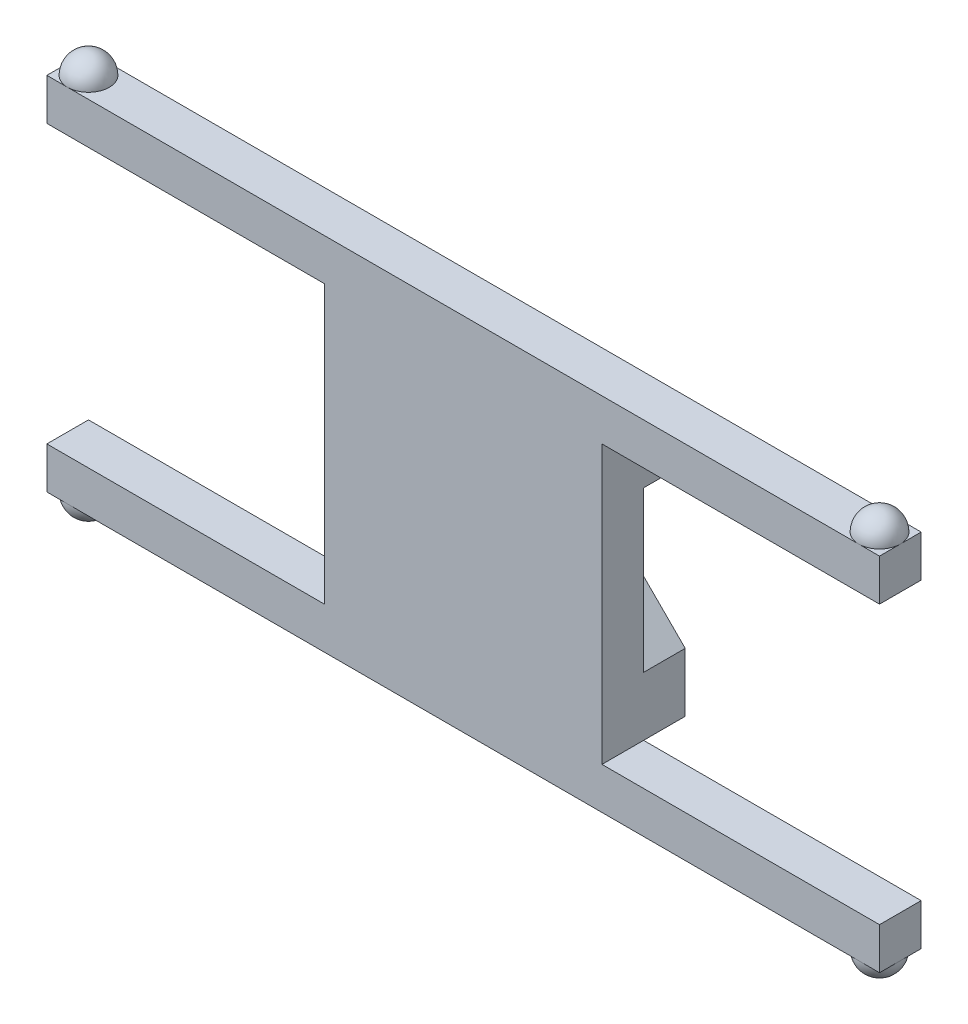
ISO-10303-21;
HEADER;
FILE_DESCRIPTION(('STEP AP214'),'2;1');
FILE_NAME('part.step','',(''),(''),'','','');
FILE_SCHEMA(('AUTOMOTIVE_DESIGN { 1 0 10303 214 1 1 1 1 }'));
ENDSEC;
DATA;
#1=APPLICATION_CONTEXT('core data for automotive mechanical design processes');
#2=APPLICATION_PROTOCOL_DEFINITION('international standard','automotive_design',2000,#1);
#3=PRODUCT_CONTEXT('',#1,'mechanical');
#4=PRODUCT('Part','Part','',(#3));
#5=PRODUCT_RELATED_PRODUCT_CATEGORY('part','',(#4));
#6=PRODUCT_DEFINITION_FORMATION('','',#4);
#7=PRODUCT_DEFINITION_CONTEXT('part definition',#1,'design');
#8=PRODUCT_DEFINITION('design','',#6,#7);
#9=PRODUCT_DEFINITION_SHAPE('','',#8);
#10=(LENGTH_UNIT() NAMED_UNIT(*) SI_UNIT(.MILLI.,.METRE.));
#11=(NAMED_UNIT(*) PLANE_ANGLE_UNIT() SI_UNIT($,.RADIAN.));
#12=(NAMED_UNIT(*) SI_UNIT($,.STERADIAN.) SOLID_ANGLE_UNIT());
#13=UNCERTAINTY_MEASURE_WITH_UNIT(LENGTH_MEASURE(1.E-05),#10,'distance_accuracy_value','');
#14=(GEOMETRIC_REPRESENTATION_CONTEXT(3) GLOBAL_UNCERTAINTY_ASSIGNED_CONTEXT((#13)) GLOBAL_UNIT_ASSIGNED_CONTEXT((#10,
#11,#12)) REPRESENTATION_CONTEXT('',''));
#15=CARTESIAN_POINT('',(0.,0.,0.));
#16=DIRECTION('',(0.,0.,1.));
#17=DIRECTION('',(1.,0.,0.));
#18=AXIS2_PLACEMENT_3D('',#15,#16,#17);
#19=CARTESIAN_POINT('',(-27.,3.,3.));
#20=DIRECTION('',(0.,1.,0.));
#21=DIRECTION('',(0.,0.,1.));
#22=AXIS2_PLACEMENT_3D('',#19,#20,#21);
#23=PLANE('',#22);
#24=CARTESIAN_POINT('',(-28.5,3.,1.5));
#25=DIRECTION('',(0.,1.,0.));
#26=DIRECTION('',(0.,0.,1.));
#27=AXIS2_PLACEMENT_3D('',#24,#25,#26);
#28=CIRCLE('',#27,1.5);
#29=CARTESIAN_POINT('',(-28.5,3.,3.));
#30=VERTEX_POINT('',#29);
#31=CARTESIAN_POINT('',(-28.5,3.,0.));
#32=VERTEX_POINT('',#31);
#33=EDGE_CURVE('E11',#30,#32,#28,.T.);
#34=ORIENTED_EDGE('',*,*,#33,.F.);
#35=DIRECTION('',(-1.,0.,0.));
#36=VECTOR('',#35,1.);
#37=CARTESIAN_POINT('',(-27.,3.,3.));
#38=LINE('',#37,#36);
#39=CARTESIAN_POINT('',(28.5,3.,3.));
#40=VERTEX_POINT('',#39);
#41=EDGE_CURVE('E248',#40,#30,#38,.T.);
#42=ORIENTED_EDGE('',*,*,#41,.F.);
#43=CARTESIAN_POINT('',(28.5,3.,1.5));
#44=DIRECTION('',(0.,-1.,0.));
#45=DIRECTION('',(0.,0.,-1.));
#46=AXIS2_PLACEMENT_3D('',#43,#44,#45);
#47=CIRCLE('',#46,1.5);
#48=CARTESIAN_POINT('',(28.5,3.00000000000001,0.));
#49=VERTEX_POINT('',#48);
#50=EDGE_CURVE('E393',#40,#49,#47,.T.);
#51=ORIENTED_EDGE('',*,*,#50,.T.);
#52=DIRECTION('',(1.,0.,0.));
#53=VECTOR('',#52,1.);
#54=CARTESIAN_POINT('',(-27.,3.,0.));
#55=LINE('',#54,#53);
#56=EDGE_CURVE('E262',#32,#49,#55,.T.);
#57=ORIENTED_EDGE('',*,*,#56,.F.);
#58=EDGE_LOOP('',(#34,#42,#51,#57));
#59=FACE_BOUND('',#58,.T.);
#60=ADVANCED_FACE('F37',(#59),#23,.T.);
#61=CARTESIAN_POINT('',(-30.,3.,1.5));
#62=VERTEX_POINT('',#61);
#63=EDGE_CURVE('E46',#32,#62,#28,.T.);
#64=ORIENTED_EDGE('',*,*,#63,.F.);
#65=CARTESIAN_POINT('',(-30.,3.,0.));
#66=VERTEX_POINT('',#65);
#67=EDGE_CURVE('E261',#66,#32,#55,.T.);
#68=ORIENTED_EDGE('',*,*,#67,.F.);
#69=DIRECTION('',(0.,0.,-1.));
#70=VECTOR('',#69,1.);
#71=CARTESIAN_POINT('',(-30.,3.,3.));
#72=LINE('',#71,#70);
#73=EDGE_CURVE('E288',#62,#66,#72,.T.);
#74=ORIENTED_EDGE('',*,*,#73,.F.);
#75=EDGE_LOOP('',(#64,#68,#74));
#76=FACE_BOUND('',#75,.T.);
#77=ADVANCED_FACE('F597',(#76),#23,.T.);
#78=CARTESIAN_POINT('',(27.,-23.,3.));
#79=DIRECTION('',(0.,1.,0.));
#80=DIRECTION('',(0.,0.,1.));
#81=AXIS2_PLACEMENT_3D('',#78,#79,#80);
#82=PLANE('',#81);
#83=DIRECTION('',(1.,0.,0.));
#84=VECTOR('',#83,1.);
#85=CARTESIAN_POINT('',(-29.9999999999998,-23.0000000000002,3.));
#86=LINE('',#85,#84);
#87=CARTESIAN_POINT('',(-28.4999999999998,-23.,3.));
#88=VERTEX_POINT('',#87);
#89=CARTESIAN_POINT('',(28.5,-23.,3.));
#90=VERTEX_POINT('',#89);
#91=EDGE_CURVE('E376',#88,#90,#86,.T.);
#92=ORIENTED_EDGE('',*,*,#91,.F.);
#93=CARTESIAN_POINT('',(-28.4999999999998,-23.,1.5));
#94=DIRECTION('',(0.,1.,0.));
#95=DIRECTION('',(0.,0.,1.));
#96=AXIS2_PLACEMENT_3D('',#93,#94,#95);
#97=CIRCLE('',#96,1.5);
#98=CARTESIAN_POINT('',(-28.4999999999998,-23.,0.));
#99=VERTEX_POINT('',#98);
#100=EDGE_CURVE('E266',#88,#99,#97,.T.);
#101=ORIENTED_EDGE('',*,*,#100,.T.);
#102=DIRECTION('',(1.,0.,0.));
#103=VECTOR('',#102,1.);
#104=CARTESIAN_POINT('',(27.,-23.,0.));
#105=LINE('',#104,#103);
#106=CARTESIAN_POINT('',(28.5,-23.,0.));
#107=VERTEX_POINT('',#106);
#108=EDGE_CURVE('E342',#99,#107,#105,.T.);
#109=ORIENTED_EDGE('',*,*,#108,.T.);
#110=CARTESIAN_POINT('',(28.5,-23.,1.5));
#111=DIRECTION('',(0.,1.,0.));
#112=DIRECTION('',(0.,0.,1.));
#113=AXIS2_PLACEMENT_3D('',#110,#111,#112);
#114=CIRCLE('',#113,1.5);
#115=EDGE_CURVE('E276',#90,#107,#114,.F.);
#116=ORIENTED_EDGE('',*,*,#115,.F.);
#117=EDGE_LOOP('',(#92,#101,#109,#116));
#118=FACE_BOUND('',#117,.T.);
#119=ADVANCED_FACE('F602',(#118),#82,.F.);
#120=CARTESIAN_POINT('',(-29.9999999999998,-23.0000000000002,0.));
#121=VERTEX_POINT('',#120);
#122=EDGE_CURVE('E339',#121,#99,#105,.T.);
#123=ORIENTED_EDGE('',*,*,#122,.T.);
#124=CARTESIAN_POINT('',(-29.9999999999998,-23.,1.5));
#125=VERTEX_POINT('',#124);
#126=EDGE_CURVE('E268',#99,#125,#97,.T.);
#127=ORIENTED_EDGE('',*,*,#126,.T.);
#128=DIRECTION('',(0.,0.,-1.));
#129=VECTOR('',#128,1.);
#130=CARTESIAN_POINT('',(-29.9999999999998,-23.0000000000002,3.));
#131=LINE('',#130,#129);
#132=EDGE_CURVE('E303',#125,#121,#131,.T.);
#133=ORIENTED_EDGE('',*,*,#132,.T.);
#134=EDGE_LOOP('',(#123,#127,#133));
#135=FACE_BOUND('',#134,.T.);
#136=ADVANCED_FACE('F665',(#135),#82,.F.);
#137=CARTESIAN_POINT('',(-29.9999999999998,-23.0000000000002,3.));
#138=VERTEX_POINT('',#137);
#139=EDGE_CURVE('E301',#138,#125,#131,.T.);
#140=ORIENTED_EDGE('',*,*,#139,.T.);
#141=EDGE_CURVE('E269',#125,#88,#97,.T.);
#142=ORIENTED_EDGE('',*,*,#141,.T.);
#143=EDGE_CURVE('E373',#138,#88,#86,.T.);
#144=ORIENTED_EDGE('',*,*,#143,.F.);
#145=EDGE_LOOP('',(#140,#142,#144));
#146=FACE_BOUND('',#145,.T.);
#147=ADVANCED_FACE('F661',(#146),#82,.F.);
#148=CARTESIAN_POINT('',(30.,-23.,1.5));
#149=VERTEX_POINT('',#148);
#150=EDGE_CURVE('E281',#107,#149,#114,.F.);
#151=ORIENTED_EDGE('',*,*,#150,.F.);
#152=CARTESIAN_POINT('',(30.,-23.,0.));
#153=VERTEX_POINT('',#152);
#154=EDGE_CURVE('E343',#107,#153,#105,.T.);
#155=ORIENTED_EDGE('',*,*,#154,.T.);
#156=DIRECTION('',(0.,0.,-1.));
#157=VECTOR('',#156,1.);
#158=CARTESIAN_POINT('',(30.,-23.,3.));
#159=LINE('',#158,#157);
#160=EDGE_CURVE('E307',#149,#153,#159,.T.);
#161=ORIENTED_EDGE('',*,*,#160,.F.);
#162=EDGE_LOOP('',(#151,#155,#161));
#163=FACE_BOUND('',#162,.T.);
#164=ADVANCED_FACE('F664',(#163),#82,.F.);
#165=EDGE_CURVE('E282',#149,#90,#114,.F.);
#166=ORIENTED_EDGE('',*,*,#165,.F.);
#167=CARTESIAN_POINT('',(30.,-23.,3.));
#168=VERTEX_POINT('',#167);
#169=EDGE_CURVE('E304',#168,#149,#159,.T.);
#170=ORIENTED_EDGE('',*,*,#169,.F.);
#171=EDGE_CURVE('E377',#90,#168,#86,.T.);
#172=ORIENTED_EDGE('',*,*,#171,.F.);
#173=EDGE_LOOP('',(#166,#170,#172));
#174=FACE_BOUND('',#173,.T.);
#175=ADVANCED_FACE('F666',(#174),#82,.F.);
#176=CARTESIAN_POINT('',(0.,0.,0.));
#177=DIRECTION('',(0.,0.,1.));
#178=DIRECTION('',(1.,0.,0.));
#179=AXIS2_PLACEMENT_3D('',#176,#177,#178);
#180=PLANE('',#179);
#181=DIRECTION('',(-0.707106781186547,-0.707106781186548,0.));
#182=VECTOR('',#181,1.);
#183=CARTESIAN_POINT('',(7.12132034355964,-7.12132034355963,0.));
#184=LINE('',#183,#182);
#185=CARTESIAN_POINT('',(10.,-4.24264068711927,0.));
#186=VERTEX_POINT('',#185);
#187=CARTESIAN_POINT('',(4.24264068711928,-9.99999999999999,0.));
#188=VERTEX_POINT('',#187);
#189=EDGE_CURVE('E463',#186,#188,#184,.T.);
#190=ORIENTED_EDGE('',*,*,#189,.F.);
#191=DIRECTION('',(0.,-1.,0.));
#192=VECTOR('',#191,1.);
#193=CARTESIAN_POINT('',(10.,0.,0.));
#194=LINE('',#193,#192);
#195=CARTESIAN_POINT('',(10.,-15.7573593128807,0.));
#196=VERTEX_POINT('',#195);
#197=EDGE_CURVE('E330',#186,#196,#194,.T.);
#198=ORIENTED_EDGE('',*,*,#197,.T.);
#199=DIRECTION('',(0.707106781186548,-0.707106781186548,0.));
#200=VECTOR('',#199,1.);
#201=CARTESIAN_POINT('',(-2.87867965644036,-2.87867965644036,0.));
#202=LINE('',#201,#200);
#203=EDGE_CURVE('E461',#188,#196,#202,.T.);
#204=ORIENTED_EDGE('',*,*,#203,.F.);
#205=EDGE_LOOP('',(#190,#198,#204));
#206=FACE_BOUND('',#205,.T.);
#207=ADVANCED_FACE('F518',(#206),#180,.F.);
#208=DIRECTION('',(0.707106781186548,-0.707106781186548,0.));
#209=VECTOR('',#208,1.);
#210=CARTESIAN_POINT('',(-7.12132034355964,-7.12132034355964,0.));
#211=LINE('',#210,#209);
#212=CARTESIAN_POINT('',(0.,-14.2426406871193,0.));
#213=VERTEX_POINT('',#212);
#214=CARTESIAN_POINT('',(5.75735931288072,-20.,0.));
#215=VERTEX_POINT('',#214);
#216=EDGE_CURVE('E455',#213,#215,#211,.T.);
#217=ORIENTED_EDGE('',*,*,#216,.T.);
#218=DIRECTION('',(1.,0.,0.));
#219=VECTOR('',#218,1.);
#220=CARTESIAN_POINT('',(0.,-20.,0.));
#221=LINE('',#220,#219);
#222=CARTESIAN_POINT('',(10.,-20.,0.));
#223=VERTEX_POINT('',#222);
#224=EDGE_CURVE('E458',#215,#223,#221,.T.);
#225=ORIENTED_EDGE('',*,*,#224,.T.);
#226=DIRECTION('',(1.,0.,0.));
#227=VECTOR('',#226,1.);
#228=CARTESIAN_POINT('',(10.,-20.,0.));
#229=LINE('',#228,#227);
#230=CARTESIAN_POINT('',(30.,-20.,0.));
#231=VERTEX_POINT('',#230);
#232=EDGE_CURVE('E333',#223,#231,#229,.T.);
#233=ORIENTED_EDGE('',*,*,#232,.T.);
#234=DIRECTION('',(0.,1.,0.));
#235=VECTOR('',#234,1.);
#236=CARTESIAN_POINT('',(30.,-23.,0.));
#237=LINE('',#236,#235);
#238=EDGE_CURVE('E336',#153,#231,#237,.T.);
#239=ORIENTED_EDGE('',*,*,#238,.F.);
#240=ORIENTED_EDGE('',*,*,#154,.F.);
#241=ORIENTED_EDGE('',*,*,#108,.F.);
#242=ORIENTED_EDGE('',*,*,#122,.F.);
#243=DIRECTION('',(0.,1.,0.));
#244=VECTOR('',#243,1.);
#245=CARTESIAN_POINT('',(-29.9999999999998,-23.0000000000002,0.));
#246=LINE('',#245,#244);
#247=CARTESIAN_POINT('',(-29.9999999999999,-20.0000000000002,0.));
#248=VERTEX_POINT('',#247);
#249=EDGE_CURVE('E344',#121,#248,#246,.T.);
#250=ORIENTED_EDGE('',*,*,#249,.T.);
#251=DIRECTION('',(-1.,0.,0.));
#252=VECTOR('',#251,1.);
#253=CARTESIAN_POINT('',(-9.99999999999986,-20.,0.));
#254=LINE('',#253,#252);
#255=CARTESIAN_POINT('',(-9.99999999999986,-20.,0.));
#256=VERTEX_POINT('',#255);
#257=EDGE_CURVE('E347',#256,#248,#254,.T.);
#258=ORIENTED_EDGE('',*,*,#257,.F.);
#259=DIRECTION('',(1.,0.,0.));
#260=VECTOR('',#259,1.);
#261=CARTESIAN_POINT('',(0.,-20.,0.));
#262=LINE('',#261,#260);
#263=CARTESIAN_POINT('',(-5.75735931288072,-20.,0.));
#264=VERTEX_POINT('',#263);
#265=EDGE_CURVE('E449',#256,#264,#262,.T.);
#266=ORIENTED_EDGE('',*,*,#265,.T.);
#267=DIRECTION('',(-0.707106781186547,-0.707106781186548,0.));
#268=VECTOR('',#267,1.);
#269=CARTESIAN_POINT('',(7.12132034355964,-7.12132034355963,0.));
#270=LINE('',#269,#268);
#271=EDGE_CURVE('E452',#213,#264,#270,.T.);
#272=ORIENTED_EDGE('',*,*,#271,.F.);
#273=EDGE_LOOP('',(#217,#225,#233,#239,#240,#241,#242,#250,#258,#266,#272));
#274=FACE_BOUND('',#273,.T.);
#275=ADVANCED_FACE('F585',(#274),#180,.F.);
#276=DIRECTION('',(0.707106781186548,-0.707106781186548,0.));
#277=VECTOR('',#276,1.);
#278=CARTESIAN_POINT('',(-7.12132034355964,-7.12132034355964,0.));
#279=LINE('',#278,#277);
#280=CARTESIAN_POINT('',(-9.99999999999997,-4.24264068711931,0.));
#281=VERTEX_POINT('',#280);
#282=CARTESIAN_POINT('',(-4.24264068711924,-10.,0.));
#283=VERTEX_POINT('',#282);
#284=EDGE_CURVE('E443',#281,#283,#279,.T.);
#285=ORIENTED_EDGE('',*,*,#284,.T.);
#286=DIRECTION('',(-0.707106781186545,-0.70710678118655,0.));
#287=VECTOR('',#286,1.);
#288=CARTESIAN_POINT('',(2.87867965644038,-2.87867965644036,0.));
#289=LINE('',#288,#287);
#290=CARTESIAN_POINT('',(-9.99999999999989,-15.7573593128807,0.));
#291=VERTEX_POINT('',#290);
#292=EDGE_CURVE('E446',#283,#291,#289,.T.);
#293=ORIENTED_EDGE('',*,*,#292,.T.);
#294=DIRECTION('',(0.,-1.,0.));
#295=VECTOR('',#294,1.);
#296=CARTESIAN_POINT('',(-10.,0.,0.));
#297=LINE('',#296,#295);
#298=EDGE_CURVE('E350',#281,#291,#297,.T.);
#299=ORIENTED_EDGE('',*,*,#298,.F.);
#300=EDGE_LOOP('',(#285,#293,#299));
#301=FACE_BOUND('',#300,.T.);
#302=ADVANCED_FACE('F607',(#301),#180,.F.);
#303=EDGE_CURVE('E41',#62,#30,#28,.T.);
#304=ORIENTED_EDGE('',*,*,#303,.F.);
#305=CARTESIAN_POINT('',(-30.,3.,3.));
#306=VERTEX_POINT('',#305);
#307=EDGE_CURVE('E260',#306,#62,#72,.T.);
#308=ORIENTED_EDGE('',*,*,#307,.F.);
#309=EDGE_CURVE('E250',#30,#306,#38,.T.);
#310=ORIENTED_EDGE('',*,*,#309,.F.);
#311=EDGE_LOOP('',(#304,#308,#310));
#312=FACE_BOUND('',#311,.T.);
#313=ADVANCED_FACE('F258',(#312),#23,.T.);
#314=CARTESIAN_POINT('',(30.,3.,0.));
#315=VERTEX_POINT('',#314);
#316=EDGE_CURVE('E323',#49,#315,#55,.T.);
#317=ORIENTED_EDGE('',*,*,#316,.F.);
#318=CARTESIAN_POINT('',(30.,3.,1.5));
#319=VERTEX_POINT('',#318);
#320=EDGE_CURVE('E359',#49,#319,#47,.T.);
#321=ORIENTED_EDGE('',*,*,#320,.T.);
#322=DIRECTION('',(0.,0.,-1.));
#323=VECTOR('',#322,1.);
#324=CARTESIAN_POINT('',(30.,3.,3.));
#325=LINE('',#324,#323);
#326=EDGE_CURVE('E321',#319,#315,#325,.T.);
#327=ORIENTED_EDGE('',*,*,#326,.T.);
#328=EDGE_LOOP('',(#317,#321,#327));
#329=FACE_BOUND('',#328,.T.);
#330=ADVANCED_FACE('F603',(#329),#23,.T.);
#331=CARTESIAN_POINT('',(30.,3.,3.));
#332=VERTEX_POINT('',#331);
#333=EDGE_CURVE('E318',#332,#319,#325,.T.);
#334=ORIENTED_EDGE('',*,*,#333,.T.);
#335=EDGE_CURVE('E392',#319,#40,#47,.T.);
#336=ORIENTED_EDGE('',*,*,#335,.T.);
#337=EDGE_CURVE('E253',#332,#40,#38,.T.);
#338=ORIENTED_EDGE('',*,*,#337,.F.);
#339=EDGE_LOOP('',(#334,#336,#338));
#340=FACE_BOUND('',#339,.T.);
#341=ADVANCED_FACE('F608',(#340),#23,.T.);
#342=CARTESIAN_POINT('',(-30.,3.,3.));
#343=DIRECTION('',(1.,0.,0.));
#344=DIRECTION('',(0.,1.,0.));
#345=AXIS2_PLACEMENT_3D('',#342,#343,#344);
#346=PLANE('',#345);
#347=DIRECTION('',(0.,-1.,0.));
#348=VECTOR('',#347,1.);
#349=CARTESIAN_POINT('',(-30.,3.,0.));
#350=LINE('',#349,#348);
#351=CARTESIAN_POINT('',(-30.,-2.22044604925031E-13,0.));
#352=VERTEX_POINT('',#351);
#353=EDGE_CURVE('E356',#66,#352,#350,.T.);
#354=ORIENTED_EDGE('',*,*,#353,.T.);
#355=DIRECTION('',(0.,0.,-1.));
#356=VECTOR('',#355,1.);
#357=CARTESIAN_POINT('',(-30.,-2.22044604925031E-13,3.));
#358=LINE('',#357,#356);
#359=CARTESIAN_POINT('',(-30.,-2.22044604925031E-13,3.));
#360=VERTEX_POINT('',#359);
#361=EDGE_CURVE('E290',#360,#352,#358,.T.);
#362=ORIENTED_EDGE('',*,*,#361,.F.);
#363=DIRECTION('',(0.,-1.,0.));
#364=VECTOR('',#363,1.);
#365=CARTESIAN_POINT('',(-30.,3.,3.));
#366=LINE('',#365,#364);
#367=EDGE_CURVE('E388',#306,#360,#366,.T.);
#368=ORIENTED_EDGE('',*,*,#367,.F.);
#369=ORIENTED_EDGE('',*,*,#307,.T.);
#370=ORIENTED_EDGE('',*,*,#73,.T.);
#371=EDGE_LOOP('',(#354,#362,#368,#369,#370));
#372=FACE_BOUND('',#371,.T.);
#373=ADVANCED_FACE('F39',(#372),#346,.F.);
#374=CARTESIAN_POINT('',(-10.,0.,3.));
#375=DIRECTION('',(0.,-1.,0.));
#376=DIRECTION('',(1.,0.,0.));
#377=AXIS2_PLACEMENT_3D('',#374,#375,#376);
#378=PLANE('',#377);
#379=DIRECTION('',(-1.,0.,0.));
#380=VECTOR('',#379,1.);
#381=CARTESIAN_POINT('',(-10.,0.,0.));
#382=LINE('',#381,#380);
#383=CARTESIAN_POINT('',(-10.,0.,0.));
#384=VERTEX_POINT('',#383);
#385=EDGE_CURVE('E353',#384,#352,#382,.T.);
#386=ORIENTED_EDGE('',*,*,#385,.F.);
#387=DIRECTION('',(0.,0.,-1.));
#388=VECTOR('',#387,1.);
#389=CARTESIAN_POINT('',(-10.,0.,3.));
#390=LINE('',#389,#388);
#391=CARTESIAN_POINT('',(-10.,0.,3.));
#392=VERTEX_POINT('',#391);
#393=EDGE_CURVE('E293',#392,#384,#390,.T.);
#394=ORIENTED_EDGE('',*,*,#393,.F.);
#395=DIRECTION('',(-1.,0.,0.));
#396=VECTOR('',#395,1.);
#397=CARTESIAN_POINT('',(-10.,0.,3.));
#398=LINE('',#397,#396);
#399=EDGE_CURVE('E385',#392,#360,#398,.T.);
#400=ORIENTED_EDGE('',*,*,#399,.T.);
#401=ORIENTED_EDGE('',*,*,#361,.T.);
#402=EDGE_LOOP('',(#386,#394,#400,#401));
#403=FACE_BOUND('',#402,.T.);
#404=ADVANCED_FACE('F621',(#403),#378,.T.);
#405=CARTESIAN_POINT('',(-10.,0.,3.));
#406=DIRECTION('',(1.,0.,0.));
#407=DIRECTION('',(0.,1.,0.));
#408=AXIS2_PLACEMENT_3D('',#405,#406,#407);
#409=PLANE('',#408);
#410=ORIENTED_EDGE('',*,*,#393,.T.);
#411=DIRECTION('',(0.,0.,1.));
#412=VECTOR('',#411,1.);
#413=CARTESIAN_POINT('',(-10.,0.,-3.));
#414=LINE('',#413,#412);
#415=CARTESIAN_POINT('',(-10.,0.,-3.));
#416=VERTEX_POINT('',#415);
#417=EDGE_CURVE('E418',#416,#384,#414,.T.);
#418=ORIENTED_EDGE('',*,*,#417,.F.);
#419=DIRECTION('',(0.,1.,0.));
#420=VECTOR('',#419,1.);
#421=CARTESIAN_POINT('',(-10.,0.,-3.));
#422=LINE('',#421,#420);
#423=CARTESIAN_POINT('',(-9.99999999999997,-4.24264068711931,-3.));
#424=VERTEX_POINT('',#423);
#425=EDGE_CURVE('E475',#424,#416,#422,.T.);
#426=ORIENTED_EDGE('',*,*,#425,.F.);
#427=DIRECTION('',(0.,0.,1.));
#428=VECTOR('',#427,1.);
#429=CARTESIAN_POINT('',(-9.99999999999997,-4.24264068711931,-3.));
#430=LINE('',#429,#428);
#431=EDGE_CURVE('E416',#424,#281,#430,.T.);
#432=ORIENTED_EDGE('',*,*,#431,.T.);
#433=ORIENTED_EDGE('',*,*,#298,.T.);
#434=DIRECTION('',(0.,0.,1.));
#435=VECTOR('',#434,1.);
#436=CARTESIAN_POINT('',(-9.99999999999989,-15.7573593128807,-3.));
#437=LINE('',#436,#435);
#438=CARTESIAN_POINT('',(-9.99999999999989,-15.7573593128807,-3.));
#439=VERTEX_POINT('',#438);
#440=EDGE_CURVE('E412',#439,#291,#437,.T.);
#441=ORIENTED_EDGE('',*,*,#440,.F.);
#442=DIRECTION('',(0.,1.,0.));
#443=VECTOR('',#442,1.);
#444=CARTESIAN_POINT('',(-10.,0.,-3.));
#445=LINE('',#444,#443);
#446=CARTESIAN_POINT('',(-9.99999999999986,-20.,-3.));
#447=VERTEX_POINT('',#446);
#448=EDGE_CURVE('E483',#447,#439,#445,.T.);
#449=ORIENTED_EDGE('',*,*,#448,.F.);
#450=DIRECTION('',(0.,0.,1.));
#451=VECTOR('',#450,1.);
#452=CARTESIAN_POINT('',(-9.99999999999986,-20.,-3.));
#453=LINE('',#452,#451);
#454=EDGE_CURVE('E410',#447,#256,#453,.T.);
#455=ORIENTED_EDGE('',*,*,#454,.T.);
#456=DIRECTION('',(0.,0.,-1.));
#457=VECTOR('',#456,1.);
#458=CARTESIAN_POINT('',(-9.99999999999986,-20.,3.));
#459=LINE('',#458,#457);
#460=CARTESIAN_POINT('',(-9.99999999999986,-20.,3.));
#461=VERTEX_POINT('',#460);
#462=EDGE_CURVE('E296',#461,#256,#459,.T.);
#463=ORIENTED_EDGE('',*,*,#462,.F.);
#464=DIRECTION('',(0.,-1.,0.));
#465=VECTOR('',#464,1.);
#466=CARTESIAN_POINT('',(-10.,0.,3.));
#467=LINE('',#466,#465);
#468=EDGE_CURVE('E383',#392,#461,#467,.T.);
#469=ORIENTED_EDGE('',*,*,#468,.F.);
#470=EDGE_LOOP('',(#410,#418,#426,#432,#433,#441,#449,#455,#463,#469));
#471=FACE_BOUND('',#470,.T.);
#472=ADVANCED_FACE('F546',(#471),#409,.F.);
#473=CARTESIAN_POINT('',(-9.99999999999986,-20.,3.));
#474=DIRECTION('',(0.,-1.,0.));
#475=DIRECTION('',(1.,0.,0.));
#476=AXIS2_PLACEMENT_3D('',#473,#474,#475);
#477=PLANE('',#476);
#478=ORIENTED_EDGE('',*,*,#257,.T.);
#479=DIRECTION('',(0.,0.,-1.));
#480=VECTOR('',#479,1.);
#481=CARTESIAN_POINT('',(-29.9999999999999,-20.0000000000002,3.));
#482=LINE('',#481,#480);
#483=CARTESIAN_POINT('',(-29.9999999999999,-20.0000000000002,3.));
#484=VERTEX_POINT('',#483);
#485=EDGE_CURVE('E299',#484,#248,#482,.T.);
#486=ORIENTED_EDGE('',*,*,#485,.F.);
#487=DIRECTION('',(-1.,0.,0.));
#488=VECTOR('',#487,1.);
#489=CARTESIAN_POINT('',(-9.99999999999986,-20.,3.));
#490=LINE('',#489,#488);
#491=EDGE_CURVE('E381',#461,#484,#490,.T.);
#492=ORIENTED_EDGE('',*,*,#491,.F.);
#493=ORIENTED_EDGE('',*,*,#462,.T.);
#494=EDGE_LOOP('',(#478,#486,#492,#493));
#495=FACE_BOUND('',#494,.T.);
#496=ADVANCED_FACE('F669',(#495),#477,.F.);
#497=CARTESIAN_POINT('',(-29.9999999999998,-23.0000000000002,3.));
#498=DIRECTION('',(-1.,0.,0.));
#499=DIRECTION('',(0.,-1.,0.));
#500=AXIS2_PLACEMENT_3D('',#497,#498,#499);
#501=PLANE('',#500);
#502=ORIENTED_EDGE('',*,*,#249,.F.);
#503=ORIENTED_EDGE('',*,*,#132,.F.);
#504=ORIENTED_EDGE('',*,*,#139,.F.);
#505=DIRECTION('',(0.,1.,0.));
#506=VECTOR('',#505,1.);
#507=CARTESIAN_POINT('',(-29.9999999999998,-23.0000000000002,3.));
#508=LINE('',#507,#506);
#509=EDGE_CURVE('E378',#138,#484,#508,.T.);
#510=ORIENTED_EDGE('',*,*,#509,.T.);
#511=ORIENTED_EDGE('',*,*,#485,.T.);
#512=EDGE_LOOP('',(#502,#503,#504,#510,#511));
#513=FACE_BOUND('',#512,.T.);
#514=ADVANCED_FACE('F659',(#513),#501,.T.);
#515=CARTESIAN_POINT('',(30.,-23.,3.));
#516=DIRECTION('',(-1.,0.,0.));
#517=DIRECTION('',(0.,0.,1.));
#518=AXIS2_PLACEMENT_3D('',#515,#516,#517);
#519=PLANE('',#518);
#520=ORIENTED_EDGE('',*,*,#238,.T.);
#521=DIRECTION('',(0.,0.,-1.));
#522=VECTOR('',#521,1.);
#523=CARTESIAN_POINT('',(30.,-20.,3.));
#524=LINE('',#523,#522);
#525=CARTESIAN_POINT('',(30.,-20.,3.));
#526=VERTEX_POINT('',#525);
#527=EDGE_CURVE('E308',#526,#231,#524,.T.);
#528=ORIENTED_EDGE('',*,*,#527,.F.);
#529=DIRECTION('',(0.,1.,0.));
#530=VECTOR('',#529,1.);
#531=CARTESIAN_POINT('',(30.,-23.,3.));
#532=LINE('',#531,#530);
#533=EDGE_CURVE('E371',#168,#526,#532,.T.);
#534=ORIENTED_EDGE('',*,*,#533,.F.);
#535=ORIENTED_EDGE('',*,*,#169,.T.);
#536=ORIENTED_EDGE('',*,*,#160,.T.);
#537=EDGE_LOOP('',(#520,#528,#534,#535,#536));
#538=FACE_BOUND('',#537,.T.);
#539=ADVANCED_FACE('F656',(#538),#519,.F.);
#540=CARTESIAN_POINT('',(10.,-20.,3.));
#541=DIRECTION('',(0.,1.,0.));
#542=DIRECTION('',(0.,0.,1.));
#543=AXIS2_PLACEMENT_3D('',#540,#541,#542);
#544=PLANE('',#543);
#545=ORIENTED_EDGE('',*,*,#232,.F.);
#546=DIRECTION('',(0.,0.,-1.));
#547=VECTOR('',#546,1.);
#548=CARTESIAN_POINT('',(10.,-20.,3.));
#549=LINE('',#548,#547);
#550=CARTESIAN_POINT('',(10.,-20.,3.));
#551=VERTEX_POINT('',#550);
#552=EDGE_CURVE('E310',#551,#223,#549,.T.);
#553=ORIENTED_EDGE('',*,*,#552,.F.);
#554=DIRECTION('',(1.,0.,0.));
#555=VECTOR('',#554,1.);
#556=CARTESIAN_POINT('',(10.,-20.,3.));
#557=LINE('',#556,#555);
#558=EDGE_CURVE('E368',#551,#526,#557,.T.);
#559=ORIENTED_EDGE('',*,*,#558,.T.);
#560=ORIENTED_EDGE('',*,*,#527,.T.);
#561=EDGE_LOOP('',(#545,#553,#559,#560));
#562=FACE_BOUND('',#561,.T.);
#563=ADVANCED_FACE('F582',(#562),#544,.T.);
#564=CARTESIAN_POINT('',(10.,0.,3.));
#565=DIRECTION('',(1.,0.,0.));
#566=DIRECTION('',(0.,0.,-1.));
#567=AXIS2_PLACEMENT_3D('',#564,#565,#566);
#568=PLANE('',#567);
#569=ORIENTED_EDGE('',*,*,#197,.F.);
#570=DIRECTION('',(0.,0.,1.));
#571=VECTOR('',#570,1.);
#572=CARTESIAN_POINT('',(10.,-4.24264068711927,-3.));
#573=LINE('',#572,#571);
#574=CARTESIAN_POINT('',(10.,-4.24264068711927,-3.));
#575=VERTEX_POINT('',#574);
#576=EDGE_CURVE('E394',#575,#186,#573,.T.);
#577=ORIENTED_EDGE('',*,*,#576,.F.);
#578=DIRECTION('',(0.,-1.,0.));
#579=VECTOR('',#578,1.);
#580=CARTESIAN_POINT('',(10.,0.,-3.));
#581=LINE('',#580,#579);
#582=CARTESIAN_POINT('',(10.,0.,-3.));
#583=VERTEX_POINT('',#582);
#584=EDGE_CURVE('E433',#583,#575,#581,.T.);
#585=ORIENTED_EDGE('',*,*,#584,.F.);
#586=DIRECTION('',(0.,0.,1.));
#587=VECTOR('',#586,1.);
#588=CARTESIAN_POINT('',(10.,0.,-3.));
#589=LINE('',#588,#587);
#590=CARTESIAN_POINT('',(10.,0.,0.));
#591=VERTEX_POINT('',#590);
#592=EDGE_CURVE('E427',#583,#591,#589,.T.);
#593=ORIENTED_EDGE('',*,*,#592,.T.);
#594=DIRECTION('',(0.,0.,-1.));
#595=VECTOR('',#594,1.);
#596=CARTESIAN_POINT('',(10.,0.,3.));
#597=LINE('',#596,#595);
#598=CARTESIAN_POINT('',(10.,0.,3.));
#599=VERTEX_POINT('',#598);
#600=EDGE_CURVE('E313',#599,#591,#597,.T.);
#601=ORIENTED_EDGE('',*,*,#600,.F.);
#602=DIRECTION('',(0.,-1.,0.));
#603=VECTOR('',#602,1.);
#604=CARTESIAN_POINT('',(10.,0.,3.));
#605=LINE('',#604,#603);
#606=EDGE_CURVE('E365',#599,#551,#605,.T.);
#607=ORIENTED_EDGE('',*,*,#606,.T.);
#608=ORIENTED_EDGE('',*,*,#552,.T.);
#609=DIRECTION('',(0.,0.,1.));
#610=VECTOR('',#609,1.);
#611=CARTESIAN_POINT('',(10.,-20.,-3.));
#612=LINE('',#611,#610);
#613=CARTESIAN_POINT('',(10.,-20.,-3.));
#614=VERTEX_POINT('',#613);
#615=EDGE_CURVE('E402',#614,#223,#612,.T.);
#616=ORIENTED_EDGE('',*,*,#615,.F.);
#617=DIRECTION('',(0.,-1.,0.));
#618=VECTOR('',#617,1.);
#619=CARTESIAN_POINT('',(10.,0.,-3.));
#620=LINE('',#619,#618);
#621=CARTESIAN_POINT('',(10.,-15.7573593128807,-3.));
#622=VERTEX_POINT('',#621);
#623=EDGE_CURVE('E496',#622,#614,#620,.T.);
#624=ORIENTED_EDGE('',*,*,#623,.F.);
#625=DIRECTION('',(0.,0.,1.));
#626=VECTOR('',#625,1.);
#627=CARTESIAN_POINT('',(10.,-15.7573593128807,-3.));
#628=LINE('',#627,#626);
#629=EDGE_CURVE('E399',#622,#196,#628,.T.);
#630=ORIENTED_EDGE('',*,*,#629,.T.);
#631=EDGE_LOOP('',(#569,#577,#585,#593,#601,#607,#608,#616,#624,#630));
#632=FACE_BOUND('',#631,.T.);
#633=ADVANCED_FACE('F512',(#632),#568,.T.);
#634=CARTESIAN_POINT('',(10.,0.,3.));
#635=DIRECTION('',(0.,1.,0.));
#636=DIRECTION('',(0.,0.,1.));
#637=AXIS2_PLACEMENT_3D('',#634,#635,#636);
#638=PLANE('',#637);
#639=DIRECTION('',(1.,0.,0.));
#640=VECTOR('',#639,1.);
#641=CARTESIAN_POINT('',(10.,0.,0.));
#642=LINE('',#641,#640);
#643=CARTESIAN_POINT('',(30.,0.,0.));
#644=VERTEX_POINT('',#643);
#645=EDGE_CURVE('E327',#591,#644,#642,.T.);
#646=ORIENTED_EDGE('',*,*,#645,.T.);
#647=DIRECTION('',(0.,0.,-1.));
#648=VECTOR('',#647,1.);
#649=CARTESIAN_POINT('',(30.,0.,3.));
#650=LINE('',#649,#648);
#651=CARTESIAN_POINT('',(30.,0.,3.));
#652=VERTEX_POINT('',#651);
#653=EDGE_CURVE('E316',#652,#644,#650,.T.);
#654=ORIENTED_EDGE('',*,*,#653,.F.);
#655=DIRECTION('',(1.,0.,0.));
#656=VECTOR('',#655,1.);
#657=CARTESIAN_POINT('',(10.,0.,3.));
#658=LINE('',#657,#656);
#659=EDGE_CURVE('E363',#599,#652,#658,.T.);
#660=ORIENTED_EDGE('',*,*,#659,.F.);
#661=ORIENTED_EDGE('',*,*,#600,.T.);
#662=EDGE_LOOP('',(#646,#654,#660,#661));
#663=FACE_BOUND('',#662,.T.);
#664=ADVANCED_FACE('F576',(#663),#638,.F.);
#665=CARTESIAN_POINT('',(30.,3.,3.));
#666=DIRECTION('',(1.,0.,0.));
#667=DIRECTION('',(0.,0.,-1.));
#668=AXIS2_PLACEMENT_3D('',#665,#666,#667);
#669=PLANE('',#668);
#670=DIRECTION('',(0.,-1.,0.));
#671=VECTOR('',#670,1.);
#672=CARTESIAN_POINT('',(30.,3.,0.));
#673=LINE('',#672,#671);
#674=EDGE_CURVE('E324',#315,#644,#673,.T.);
#675=ORIENTED_EDGE('',*,*,#674,.F.);
#676=ORIENTED_EDGE('',*,*,#326,.F.);
#677=ORIENTED_EDGE('',*,*,#333,.F.);
#678=DIRECTION('',(0.,-1.,0.));
#679=VECTOR('',#678,1.);
#680=CARTESIAN_POINT('',(30.,3.,3.));
#681=LINE('',#680,#679);
#682=EDGE_CURVE('E360',#332,#652,#681,.T.);
#683=ORIENTED_EDGE('',*,*,#682,.T.);
#684=ORIENTED_EDGE('',*,*,#653,.T.);
#685=EDGE_LOOP('',(#675,#676,#677,#683,#684));
#686=FACE_BOUND('',#685,.T.);
#687=ADVANCED_FACE('F627',(#686),#669,.T.);
#688=CARTESIAN_POINT('',(0.,0.,3.));
#689=DIRECTION('',(0.,0.,1.));
#690=DIRECTION('',(1.,0.,0.));
#691=AXIS2_PLACEMENT_3D('',#688,#689,#690);
#692=PLANE('',#691);
#693=ORIENTED_EDGE('',*,*,#337,.T.);
#694=ORIENTED_EDGE('',*,*,#41,.T.);
#695=ORIENTED_EDGE('',*,*,#309,.T.);
#696=ORIENTED_EDGE('',*,*,#367,.T.);
#697=ORIENTED_EDGE('',*,*,#399,.F.);
#698=ORIENTED_EDGE('',*,*,#468,.T.);
#699=ORIENTED_EDGE('',*,*,#491,.T.);
#700=ORIENTED_EDGE('',*,*,#509,.F.);
#701=ORIENTED_EDGE('',*,*,#143,.T.);
#702=ORIENTED_EDGE('',*,*,#91,.T.);
#703=ORIENTED_EDGE('',*,*,#171,.T.);
#704=ORIENTED_EDGE('',*,*,#533,.T.);
#705=ORIENTED_EDGE('',*,*,#558,.F.);
#706=ORIENTED_EDGE('',*,*,#606,.F.);
#707=ORIENTED_EDGE('',*,*,#659,.T.);
#708=ORIENTED_EDGE('',*,*,#682,.F.);
#709=EDGE_LOOP('',(#693,#694,#695,#696,#697,#698,#699,#700,#701,#702,#703,#704,#705,#706,#707,#708));
#710=FACE_BOUND('',#709,.T.);
#711=ADVANCED_FACE('F249',(#710),#692,.T.);
#712=DIRECTION('',(0.707106781186548,-0.707106781186548,0.));
#713=VECTOR('',#712,1.);
#714=CARTESIAN_POINT('',(-2.87867965644036,-2.87867965644036,0.));
#715=LINE('',#714,#713);
#716=CARTESIAN_POINT('',(-5.75735931288072,0.,0.));
#717=VERTEX_POINT('',#716);
#718=CARTESIAN_POINT('',(0.,-5.75735931288074,0.));
#719=VERTEX_POINT('',#718);
#720=EDGE_CURVE('E437',#717,#719,#715,.T.);
#721=ORIENTED_EDGE('',*,*,#720,.F.);
#722=DIRECTION('',(-1.,0.,0.));
#723=VECTOR('',#722,1.);
#724=CARTESIAN_POINT('',(0.,0.,0.));
#725=LINE('',#724,#723);
#726=EDGE_CURVE('E440',#717,#384,#725,.T.);
#727=ORIENTED_EDGE('',*,*,#726,.T.);
#728=ORIENTED_EDGE('',*,*,#385,.T.);
#729=ORIENTED_EDGE('',*,*,#353,.F.);
#730=ORIENTED_EDGE('',*,*,#67,.T.);
#731=ORIENTED_EDGE('',*,*,#56,.T.);
#732=ORIENTED_EDGE('',*,*,#316,.T.);
#733=ORIENTED_EDGE('',*,*,#674,.T.);
#734=ORIENTED_EDGE('',*,*,#645,.F.);
#735=DIRECTION('',(-1.,0.,0.));
#736=VECTOR('',#735,1.);
#737=CARTESIAN_POINT('',(0.,0.,0.));
#738=LINE('',#737,#736);
#739=CARTESIAN_POINT('',(5.75735931288073,0.,0.));
#740=VERTEX_POINT('',#739);
#741=EDGE_CURVE('E430',#591,#740,#738,.T.);
#742=ORIENTED_EDGE('',*,*,#741,.T.);
#743=DIRECTION('',(-0.707106781186545,-0.70710678118655,0.));
#744=VECTOR('',#743,1.);
#745=CARTESIAN_POINT('',(2.87867965644038,-2.87867965644036,0.));
#746=LINE('',#745,#744);
#747=EDGE_CURVE('E434',#740,#719,#746,.T.);
#748=ORIENTED_EDGE('',*,*,#747,.T.);
#749=EDGE_LOOP('',(#721,#727,#728,#729,#730,#731,#732,#733,#734,#742,#748));
#750=FACE_BOUND('',#749,.T.);
#751=ADVANCED_FACE('F615',(#750),#180,.F.);
#752=CARTESIAN_POINT('',(28.5,3.,1.5));
#753=DIRECTION('',(-1.,0.,0.));
#754=DIRECTION('',(0.,0.,1.));
#755=AXIS2_PLACEMENT_3D('',#752,#753,#754);
#756=SPHERICAL_SURFACE('',#755,1.5);
#757=CARTESIAN_POINT('',(28.5,3.,1.5));
#758=DIRECTION('',(0.,-1.,0.));
#759=DIRECTION('',(0.,0.,-1.));
#760=AXIS2_PLACEMENT_3D('',#757,#758,#759);
#761=SPHERICAL_SURFACE('',#760,1.5);
#762=ORIENTED_EDGE('',*,*,#320,.F.);
#763=ORIENTED_EDGE('',*,*,#50,.F.);
#764=ORIENTED_EDGE('',*,*,#335,.F.);
#765=EDGE_LOOP('',(#762,#763,#764));
#766=FACE_BOUND('',#765,.T.);
#767=ADVANCED_FACE('F634',(#766),#761,.T.);
#768=CARTESIAN_POINT('',(7.12132034355964,-7.12132034355963,-3.));
#769=DIRECTION('',(-0.707106781186548,0.707106781186547,0.));
#770=DIRECTION('',(-0.707106781186547,-0.707106781186548,0.));
#771=AXIS2_PLACEMENT_3D('',#768,#769,#770);
#772=PLANE('',#771);
#773=ORIENTED_EDGE('',*,*,#189,.T.);
#774=DIRECTION('',(0.,0.,1.));
#775=VECTOR('',#774,1.);
#776=CARTESIAN_POINT('',(4.24264068711928,-9.99999999999999,-3.));
#777=LINE('',#776,#775);
#778=CARTESIAN_POINT('',(4.24264068711928,-9.99999999999999,-3.));
#779=VERTEX_POINT('',#778);
#780=EDGE_CURVE('E396',#779,#188,#777,.T.);
#781=ORIENTED_EDGE('',*,*,#780,.F.);
#782=DIRECTION('',(-0.707106781186547,-0.707106781186548,0.));
#783=VECTOR('',#782,1.);
#784=CARTESIAN_POINT('',(7.12132034355964,-7.12132034355963,-3.));
#785=LINE('',#784,#783);
#786=EDGE_CURVE('E500',#575,#779,#785,.T.);
#787=ORIENTED_EDGE('',*,*,#786,.F.);
#788=ORIENTED_EDGE('',*,*,#576,.T.);
#789=EDGE_LOOP('',(#773,#781,#787,#788));
#790=FACE_BOUND('',#789,.T.);
#791=ADVANCED_FACE('F515',(#790),#772,.F.);
#792=CARTESIAN_POINT('',(-2.87867965644036,-2.87867965644036,-3.));
#793=DIRECTION('',(-0.707106781186547,-0.707106781186547,0.));
#794=DIRECTION('',(0.707106781186548,-0.707106781186548,0.));
#795=AXIS2_PLACEMENT_3D('',#792,#793,#794);
#796=PLANE('',#795);
#797=ORIENTED_EDGE('',*,*,#203,.T.);
#798=ORIENTED_EDGE('',*,*,#629,.F.);
#799=DIRECTION('',(0.707106781186548,-0.707106781186548,0.));
#800=VECTOR('',#799,1.);
#801=CARTESIAN_POINT('',(-2.87867965644036,-2.87867965644036,-3.));
#802=LINE('',#801,#800);
#803=EDGE_CURVE('E498',#779,#622,#802,.T.);
#804=ORIENTED_EDGE('',*,*,#803,.F.);
#805=ORIENTED_EDGE('',*,*,#780,.T.);
#806=EDGE_LOOP('',(#797,#798,#804,#805));
#807=FACE_BOUND('',#806,.T.);
#808=ADVANCED_FACE('F521',(#807),#796,.F.);
#809=CARTESIAN_POINT('',(0.,-20.,-3.));
#810=DIRECTION('',(0.,-1.,0.));
#811=DIRECTION('',(0.,0.,-1.));
#812=AXIS2_PLACEMENT_3D('',#809,#810,#811);
#813=PLANE('',#812);
#814=ORIENTED_EDGE('',*,*,#224,.F.);
#815=DIRECTION('',(0.,0.,1.));
#816=VECTOR('',#815,1.);
#817=CARTESIAN_POINT('',(5.75735931288072,-20.,-3.));
#818=LINE('',#817,#816);
#819=CARTESIAN_POINT('',(5.75735931288072,-20.,-3.));
#820=VERTEX_POINT('',#819);
#821=EDGE_CURVE('E404',#820,#215,#818,.T.);
#822=ORIENTED_EDGE('',*,*,#821,.F.);
#823=DIRECTION('',(1.,0.,0.));
#824=VECTOR('',#823,1.);
#825=CARTESIAN_POINT('',(0.,-20.,-3.));
#826=LINE('',#825,#824);
#827=EDGE_CURVE('E493',#820,#614,#826,.T.);
#828=ORIENTED_EDGE('',*,*,#827,.T.);
#829=ORIENTED_EDGE('',*,*,#615,.T.);
#830=EDGE_LOOP('',(#814,#822,#828,#829));
#831=FACE_BOUND('',#830,.T.);
#832=ADVANCED_FACE('F587',(#831),#813,.T.);
#833=CARTESIAN_POINT('',(-7.12132034355964,-7.12132034355964,-3.));
#834=DIRECTION('',(-0.707106781186547,-0.707106781186547,0.));
#835=DIRECTION('',(0.707106781186548,-0.707106781186548,0.));
#836=AXIS2_PLACEMENT_3D('',#833,#834,#835);
#837=PLANE('',#836);
#838=ORIENTED_EDGE('',*,*,#216,.F.);
#839=DIRECTION('',(0.,0.,1.));
#840=VECTOR('',#839,1.);
#841=CARTESIAN_POINT('',(0.,-14.2426406871193,-3.));
#842=LINE('',#841,#840);
#843=CARTESIAN_POINT('',(0.,-14.2426406871193,-3.));
#844=VERTEX_POINT('',#843);
#845=EDGE_CURVE('E406',#844,#213,#842,.T.);
#846=ORIENTED_EDGE('',*,*,#845,.F.);
#847=DIRECTION('',(0.707106781186548,-0.707106781186548,0.));
#848=VECTOR('',#847,1.);
#849=CARTESIAN_POINT('',(-7.12132034355964,-7.12132034355964,-3.));
#850=LINE('',#849,#848);
#851=EDGE_CURVE('E490',#844,#820,#850,.T.);
#852=ORIENTED_EDGE('',*,*,#851,.T.);
#853=ORIENTED_EDGE('',*,*,#821,.T.);
#854=EDGE_LOOP('',(#838,#846,#852,#853));
#855=FACE_BOUND('',#854,.T.);
#856=ADVANCED_FACE('F530',(#855),#837,.T.);
#857=CARTESIAN_POINT('',(7.12132034355964,-7.12132034355963,-3.));
#858=DIRECTION('',(-0.707106781186548,0.707106781186547,0.));
#859=DIRECTION('',(-0.707106781186547,-0.707106781186548,0.));
#860=AXIS2_PLACEMENT_3D('',#857,#858,#859);
#861=PLANE('',#860);
#862=ORIENTED_EDGE('',*,*,#271,.T.);
#863=DIRECTION('',(0.,0.,1.));
#864=VECTOR('',#863,1.);
#865=CARTESIAN_POINT('',(-5.75735931288072,-20.,-3.));
#866=LINE('',#865,#864);
#867=CARTESIAN_POINT('',(-5.75735931288072,-20.,-3.));
#868=VERTEX_POINT('',#867);
#869=EDGE_CURVE('E408',#868,#264,#866,.T.);
#870=ORIENTED_EDGE('',*,*,#869,.F.);
#871=DIRECTION('',(-0.707106781186547,-0.707106781186548,0.));
#872=VECTOR('',#871,1.);
#873=CARTESIAN_POINT('',(7.12132034355964,-7.12132034355963,-3.));
#874=LINE('',#873,#872);
#875=EDGE_CURVE('E488',#844,#868,#874,.T.);
#876=ORIENTED_EDGE('',*,*,#875,.F.);
#877=ORIENTED_EDGE('',*,*,#845,.T.);
#878=EDGE_LOOP('',(#862,#870,#876,#877));
#879=FACE_BOUND('',#878,.T.);
#880=ADVANCED_FACE('F536',(#879),#861,.F.);
#881=CARTESIAN_POINT('',(0.,-20.,-3.));
#882=DIRECTION('',(0.,-1.,0.));
#883=DIRECTION('',(1.,0.,0.));
#884=AXIS2_PLACEMENT_3D('',#881,#882,#883);
#885=PLANE('',#884);
#886=ORIENTED_EDGE('',*,*,#265,.F.);
#887=ORIENTED_EDGE('',*,*,#454,.F.);
#888=DIRECTION('',(1.,0.,0.));
#889=VECTOR('',#888,1.);
#890=CARTESIAN_POINT('',(0.,-20.,-3.));
#891=LINE('',#890,#889);
#892=EDGE_CURVE('E485',#447,#868,#891,.T.);
#893=ORIENTED_EDGE('',*,*,#892,.T.);
#894=ORIENTED_EDGE('',*,*,#869,.T.);
#895=EDGE_LOOP('',(#886,#887,#893,#894));
#896=FACE_BOUND('',#895,.T.);
#897=ADVANCED_FACE('F543',(#896),#885,.T.);
#898=CARTESIAN_POINT('',(2.87867965644038,-2.87867965644036,-3.));
#899=DIRECTION('',(-0.70710678118655,0.707106781186545,0.));
#900=DIRECTION('',(-0.707106781186545,-0.70710678118655,0.));
#901=AXIS2_PLACEMENT_3D('',#898,#899,#900);
#902=PLANE('',#901);
#903=ORIENTED_EDGE('',*,*,#292,.F.);
#904=DIRECTION('',(0.,0.,1.));
#905=VECTOR('',#904,1.);
#906=CARTESIAN_POINT('',(-4.24264068711924,-10.,-3.));
#907=LINE('',#906,#905);
#908=CARTESIAN_POINT('',(-4.24264068711924,-10.,-3.));
#909=VERTEX_POINT('',#908);
#910=EDGE_CURVE('E414',#909,#283,#907,.T.);
#911=ORIENTED_EDGE('',*,*,#910,.F.);
#912=DIRECTION('',(-0.707106781186545,-0.70710678118655,0.));
#913=VECTOR('',#912,1.);
#914=CARTESIAN_POINT('',(2.87867965644038,-2.87867965644036,-3.));
#915=LINE('',#914,#913);
#916=EDGE_CURVE('E480',#909,#439,#915,.T.);
#917=ORIENTED_EDGE('',*,*,#916,.T.);
#918=ORIENTED_EDGE('',*,*,#440,.T.);
#919=EDGE_LOOP('',(#903,#911,#917,#918));
#920=FACE_BOUND('',#919,.T.);
#921=ADVANCED_FACE('F550',(#920),#902,.T.);
#922=CARTESIAN_POINT('',(-7.12132034355964,-7.12132034355964,-3.));
#923=DIRECTION('',(-0.707106781186547,-0.707106781186547,0.));
#924=DIRECTION('',(0.707106781186548,-0.707106781186548,0.));
#925=AXIS2_PLACEMENT_3D('',#922,#923,#924);
#926=PLANE('',#925);
#927=ORIENTED_EDGE('',*,*,#284,.F.);
#928=ORIENTED_EDGE('',*,*,#431,.F.);
#929=DIRECTION('',(0.707106781186548,-0.707106781186548,0.));
#930=VECTOR('',#929,1.);
#931=CARTESIAN_POINT('',(-7.12132034355964,-7.12132034355964,-3.));
#932=LINE('',#931,#930);
#933=EDGE_CURVE('E477',#424,#909,#932,.T.);
#934=ORIENTED_EDGE('',*,*,#933,.T.);
#935=ORIENTED_EDGE('',*,*,#910,.T.);
#936=EDGE_LOOP('',(#927,#928,#934,#935));
#937=FACE_BOUND('',#936,.T.);
#938=ADVANCED_FACE('F554',(#937),#926,.T.);
#939=CARTESIAN_POINT('',(0.,0.,-3.));
#940=DIRECTION('',(0.,1.,0.));
#941=DIRECTION('',(-1.,0.,0.));
#942=AXIS2_PLACEMENT_3D('',#939,#940,#941);
#943=PLANE('',#942);
#944=ORIENTED_EDGE('',*,*,#726,.F.);
#945=DIRECTION('',(0.,0.,1.));
#946=VECTOR('',#945,1.);
#947=CARTESIAN_POINT('',(-5.75735931288072,0.,-3.));
#948=LINE('',#947,#946);
#949=CARTESIAN_POINT('',(-5.75735931288072,0.,-3.));
#950=VERTEX_POINT('',#949);
#951=EDGE_CURVE('E420',#950,#717,#948,.T.);
#952=ORIENTED_EDGE('',*,*,#951,.F.);
#953=DIRECTION('',(-1.,0.,0.));
#954=VECTOR('',#953,1.);
#955=CARTESIAN_POINT('',(0.,0.,-3.));
#956=LINE('',#955,#954);
#957=EDGE_CURVE('E472',#950,#416,#956,.T.);
#958=ORIENTED_EDGE('',*,*,#957,.T.);
#959=ORIENTED_EDGE('',*,*,#417,.T.);
#960=EDGE_LOOP('',(#944,#952,#958,#959));
#961=FACE_BOUND('',#960,.T.);
#962=ADVANCED_FACE('F562',(#961),#943,.T.);
#963=CARTESIAN_POINT('',(-2.87867965644036,-2.87867965644036,-3.));
#964=DIRECTION('',(-0.707106781186547,-0.707106781186547,0.));
#965=DIRECTION('',(0.707106781186548,-0.707106781186548,0.));
#966=AXIS2_PLACEMENT_3D('',#963,#964,#965);
#967=PLANE('',#966);
#968=ORIENTED_EDGE('',*,*,#720,.T.);
#969=DIRECTION('',(0.,0.,1.));
#970=VECTOR('',#969,1.);
#971=CARTESIAN_POINT('',(0.,-5.75735931288074,-3.));
#972=LINE('',#971,#970);
#973=CARTESIAN_POINT('',(0.,-5.75735931288074,-3.));
#974=VERTEX_POINT('',#973);
#975=EDGE_CURVE('E422',#974,#719,#972,.T.);
#976=ORIENTED_EDGE('',*,*,#975,.F.);
#977=DIRECTION('',(0.707106781186548,-0.707106781186548,0.));
#978=VECTOR('',#977,1.);
#979=CARTESIAN_POINT('',(-2.87867965644036,-2.87867965644036,-3.));
#980=LINE('',#979,#978);
#981=EDGE_CURVE('E470',#950,#974,#980,.T.);
#982=ORIENTED_EDGE('',*,*,#981,.F.);
#983=ORIENTED_EDGE('',*,*,#951,.T.);
#984=EDGE_LOOP('',(#968,#976,#982,#983));
#985=FACE_BOUND('',#984,.T.);
#986=ADVANCED_FACE('F565',(#985),#967,.F.);
#987=CARTESIAN_POINT('',(2.87867965644038,-2.87867965644036,-3.));
#988=DIRECTION('',(-0.70710678118655,0.707106781186545,0.));
#989=DIRECTION('',(-0.707106781186545,-0.70710678118655,0.));
#990=AXIS2_PLACEMENT_3D('',#987,#988,#989);
#991=PLANE('',#990);
#992=ORIENTED_EDGE('',*,*,#747,.F.);
#993=DIRECTION('',(0.,0.,1.));
#994=VECTOR('',#993,1.);
#995=CARTESIAN_POINT('',(5.75735931288073,0.,-3.));
#996=LINE('',#995,#994);
#997=CARTESIAN_POINT('',(5.75735931288073,0.,-3.));
#998=VERTEX_POINT('',#997);
#999=EDGE_CURVE('E424',#998,#740,#996,.T.);
#1000=ORIENTED_EDGE('',*,*,#999,.F.);
#1001=DIRECTION('',(-0.707106781186545,-0.70710678118655,0.));
#1002=VECTOR('',#1001,1.);
#1003=CARTESIAN_POINT('',(2.87867965644038,-2.87867965644036,-3.));
#1004=LINE('',#1003,#1002);
#1005=EDGE_CURVE('E467',#998,#974,#1004,.T.);
#1006=ORIENTED_EDGE('',*,*,#1005,.T.);
#1007=ORIENTED_EDGE('',*,*,#975,.T.);
#1008=EDGE_LOOP('',(#992,#1000,#1006,#1007));
#1009=FACE_BOUND('',#1008,.T.);
#1010=ADVANCED_FACE('F567',(#1009),#991,.T.);
#1011=CARTESIAN_POINT('',(0.,0.,-3.));
#1012=DIRECTION('',(0.,1.,0.));
#1013=DIRECTION('',(-1.,0.,0.));
#1014=AXIS2_PLACEMENT_3D('',#1011,#1012,#1013);
#1015=PLANE('',#1014);
#1016=ORIENTED_EDGE('',*,*,#741,.F.);
#1017=ORIENTED_EDGE('',*,*,#592,.F.);
#1018=DIRECTION('',(-1.,0.,0.));
#1019=VECTOR('',#1018,1.);
#1020=CARTESIAN_POINT('',(0.,0.,-3.));
#1021=LINE('',#1020,#1019);
#1022=EDGE_CURVE('E429',#583,#998,#1021,.T.);
#1023=ORIENTED_EDGE('',*,*,#1022,.T.);
#1024=ORIENTED_EDGE('',*,*,#999,.T.);
#1025=EDGE_LOOP('',(#1016,#1017,#1023,#1024));
#1026=FACE_BOUND('',#1025,.T.);
#1027=ADVANCED_FACE('F570',(#1026),#1015,.T.);
#1028=CARTESIAN_POINT('',(0.,0.,-3.));
#1029=DIRECTION('',(0.,0.,-1.));
#1030=DIRECTION('',(-1.,0.,0.));
#1031=AXIS2_PLACEMENT_3D('',#1028,#1029,#1030);
#1032=PLANE('',#1031);
#1033=ORIENTED_EDGE('',*,*,#584,.T.);
#1034=ORIENTED_EDGE('',*,*,#786,.T.);
#1035=ORIENTED_EDGE('',*,*,#803,.T.);
#1036=ORIENTED_EDGE('',*,*,#623,.T.);
#1037=ORIENTED_EDGE('',*,*,#827,.F.);
#1038=ORIENTED_EDGE('',*,*,#851,.F.);
#1039=ORIENTED_EDGE('',*,*,#875,.T.);
#1040=ORIENTED_EDGE('',*,*,#892,.F.);
#1041=ORIENTED_EDGE('',*,*,#448,.T.);
#1042=ORIENTED_EDGE('',*,*,#916,.F.);
#1043=ORIENTED_EDGE('',*,*,#933,.F.);
#1044=ORIENTED_EDGE('',*,*,#425,.T.);
#1045=ORIENTED_EDGE('',*,*,#957,.F.);
#1046=ORIENTED_EDGE('',*,*,#981,.T.);
#1047=ORIENTED_EDGE('',*,*,#1005,.F.);
#1048=ORIENTED_EDGE('',*,*,#1022,.F.);
#1049=EDGE_LOOP('',(#1033,#1034,#1035,#1036,#1037,#1038,#1039,#1040,#1041,#1042,#1043,#1044,
#1045,#1046,#1047,#1048));
#1050=FACE_BOUND('',#1049,.T.);
#1051=ADVANCED_FACE('F507',(#1050),#1032,.T.);
#1052=CARTESIAN_POINT('',(28.5,-23.,1.5));
#1053=DIRECTION('',(-1.,0.,0.));
#1054=DIRECTION('',(0.,0.,-1.));
#1055=AXIS2_PLACEMENT_3D('',#1052,#1053,#1054);
#1056=SPHERICAL_SURFACE('',#1055,1.5);
#1057=CARTESIAN_POINT('',(28.5,-23.,1.5));
#1058=DIRECTION('',(0.,1.,0.));
#1059=DIRECTION('',(0.,0.,1.));
#1060=AXIS2_PLACEMENT_3D('',#1057,#1058,#1059);
#1061=SPHERICAL_SURFACE('',#1060,1.5);
#1062=ORIENTED_EDGE('',*,*,#165,.T.);
#1063=ORIENTED_EDGE('',*,*,#115,.T.);
#1064=ORIENTED_EDGE('',*,*,#150,.T.);
#1065=EDGE_LOOP('',(#1062,#1063,#1064));
#1066=FACE_BOUND('',#1065,.T.);
#1067=ADVANCED_FACE('F697',(#1066),#1061,.T.);
#1068=CARTESIAN_POINT('',(-28.4999999999998,-23.,1.5));
#1069=DIRECTION('',(-1.,0.,0.));
#1070=DIRECTION('',(0.,0.,1.));
#1071=AXIS2_PLACEMENT_3D('',#1068,#1069,#1070);
#1072=SPHERICAL_SURFACE('',#1071,1.5);
#1073=CARTESIAN_POINT('',(-28.4999999999998,-23.,1.5));
#1074=DIRECTION('',(0.,1.,0.));
#1075=DIRECTION('',(0.,0.,1.));
#1076=AXIS2_PLACEMENT_3D('',#1073,#1074,#1075);
#1077=SPHERICAL_SURFACE('',#1076,1.5);
#1078=ORIENTED_EDGE('',*,*,#100,.F.);
#1079=ORIENTED_EDGE('',*,*,#141,.F.);
#1080=ORIENTED_EDGE('',*,*,#126,.F.);
#1081=EDGE_LOOP('',(#1078,#1079,#1080));
#1082=FACE_BOUND('',#1081,.T.);
#1083=ADVANCED_FACE('F699',(#1082),#1077,.T.);
#1084=CARTESIAN_POINT('',(-28.5,3.,1.5));
#1085=DIRECTION('',(-1.,0.,0.));
#1086=DIRECTION('',(0.,0.,1.));
#1087=AXIS2_PLACEMENT_3D('',#1084,#1085,#1086);
#1088=SPHERICAL_SURFACE('',#1087,1.5);
#1089=CARTESIAN_POINT('',(-28.5,3.,1.5));
#1090=DIRECTION('',(0.,1.,0.));
#1091=DIRECTION('',(0.,0.,1.));
#1092=AXIS2_PLACEMENT_3D('',#1089,#1090,#1091);
#1093=SPHERICAL_SURFACE('',#1092,1.5);
#1094=ORIENTED_EDGE('',*,*,#303,.T.);
#1095=ORIENTED_EDGE('',*,*,#33,.T.);
#1096=ORIENTED_EDGE('',*,*,#63,.T.);
#1097=EDGE_LOOP('',(#1094,#1095,#1096));
#1098=FACE_BOUND('',#1097,.T.);
#1099=ADVANCED_FACE('F265',(#1098),#1093,.T.);
#1100=CLOSED_SHELL('',(#60,#77,#119,#136,#147,#164,#175,#207,#275,#302,#313,#330,#341,#373,#404,
#472,#496,#514,#539,#563,#633,#664,#687,#711,#751,#767,#791,#808,#832,#856,#880,#897,#921,#938,
#962,#986,#1010,#1027,#1051,#1067,#1083,#1099));
#1101=MANIFOLD_SOLID_BREP('B2',#1100);
#1102=ADVANCED_BREP_SHAPE_REPRESENTATION('',(#18,#1101),#14);
#1103=SHAPE_DEFINITION_REPRESENTATION(#9,#1102);
ENDSEC;
END-ISO-10303-21;
